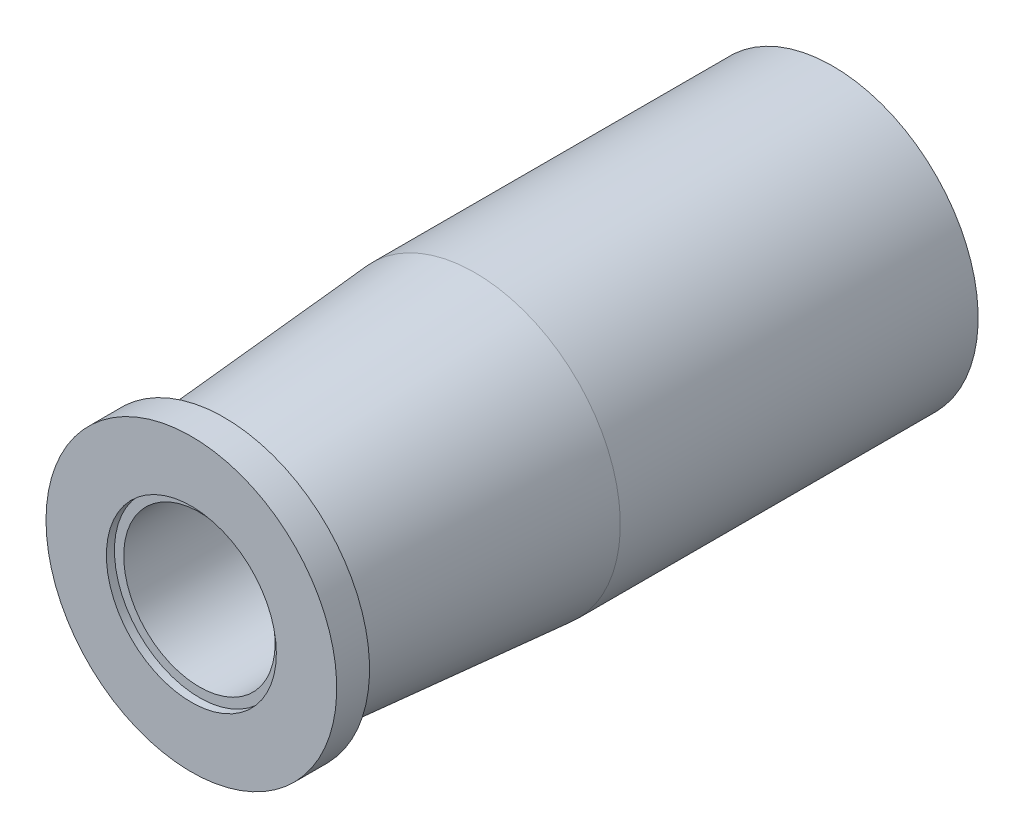
ISO-10303-21;
HEADER;
FILE_DESCRIPTION(('STEP AP214'),'2;1');
FILE_NAME('part.step','',(''),(''),'','','');
FILE_SCHEMA(('AUTOMOTIVE_DESIGN { 1 0 10303 214 1 1 1 1 }'));
ENDSEC;
DATA;
#1=APPLICATION_CONTEXT('core data for automotive mechanical design processes');
#2=APPLICATION_PROTOCOL_DEFINITION('international standard','automotive_design',2000,#1);
#3=PRODUCT_CONTEXT('',#1,'mechanical');
#4=PRODUCT('Part','Part','',(#3));
#5=PRODUCT_RELATED_PRODUCT_CATEGORY('part','',(#4));
#6=PRODUCT_DEFINITION_FORMATION('','',#4);
#7=PRODUCT_DEFINITION_CONTEXT('part definition',#1,'design');
#8=PRODUCT_DEFINITION('design','',#6,#7);
#9=PRODUCT_DEFINITION_SHAPE('','',#8);
#10=(LENGTH_UNIT() NAMED_UNIT(*) SI_UNIT(.MILLI.,.METRE.));
#11=(NAMED_UNIT(*) PLANE_ANGLE_UNIT() SI_UNIT($,.RADIAN.));
#12=(NAMED_UNIT(*) SI_UNIT($,.STERADIAN.) SOLID_ANGLE_UNIT());
#13=UNCERTAINTY_MEASURE_WITH_UNIT(LENGTH_MEASURE(1.E-05),#10,'distance_accuracy_value','');
#14=(GEOMETRIC_REPRESENTATION_CONTEXT(3) GLOBAL_UNCERTAINTY_ASSIGNED_CONTEXT((#13)) GLOBAL_UNIT_ASSIGNED_CONTEXT((#10,
#11,#12)) REPRESENTATION_CONTEXT('',''));
#15=CARTESIAN_POINT('',(0.,0.,0.));
#16=DIRECTION('',(0.,0.,1.));
#17=DIRECTION('',(1.,0.,0.));
#18=AXIS2_PLACEMENT_3D('',#15,#16,#17);
#19=CARTESIAN_POINT('',(0.,0.,0.));
#20=DIRECTION('',(0.,0.,1.));
#21=DIRECTION('',(1.,0.,0.));
#22=AXIS2_PLACEMENT_3D('',#19,#20,#21);
#23=PLANE('',#22);
#24=CARTESIAN_POINT('',(0.,0.,0.));
#25=DIRECTION('',(0.,0.,1.));
#26=DIRECTION('',(1.,0.,0.));
#27=AXIS2_PLACEMENT_3D('',#24,#25,#26);
#28=CIRCLE('',#27,2.85);
#29=CARTESIAN_POINT('',(2.85,0.,0.));
#30=VERTEX_POINT('',#29);
#31=EDGE_CURVE('E64',#30,#30,#28,.T.);
#32=ORIENTED_EDGE('',*,*,#31,.F.);
#33=EDGE_LOOP('',(#32));
#34=FACE_BOUND('',#33,.T.);
#35=CARTESIAN_POINT('',(0.,0.,0.));
#36=DIRECTION('',(0.,0.,-1.));
#37=DIRECTION('',(-1.,0.,0.));
#38=AXIS2_PLACEMENT_3D('',#35,#36,#37);
#39=CIRCLE('',#38,4.875);
#40=CARTESIAN_POINT('',(-4.875,0.,0.));
#41=VERTEX_POINT('',#40);
#42=EDGE_CURVE('E10',#41,#41,#39,.T.);
#43=ORIENTED_EDGE('',*,*,#42,.F.);
#44=EDGE_LOOP('',(#43));
#45=FACE_BOUND('',#44,.T.);
#46=ADVANCED_FACE('F41',(#34,#45),#23,.T.);
#47=CARTESIAN_POINT('',(0.,0.,-21.51));
#48=DIRECTION('',(0.,0.,-1.));
#49=DIRECTION('',(-1.,0.,0.));
#50=AXIS2_PLACEMENT_3D('',#47,#48,#49);
#51=CYLINDRICAL_SURFACE('',#50,4.875);
#52=ORIENTED_EDGE('',*,*,#42,.T.);
#53=EDGE_LOOP('',(#52));
#54=FACE_BOUND('',#53,.T.);
#55=CARTESIAN_POINT('',(0.,0.,-1.1));
#56=DIRECTION('',(0.,0.,-1.));
#57=DIRECTION('',(-1.,0.,0.));
#58=AXIS2_PLACEMENT_3D('',#55,#56,#57);
#59=CIRCLE('',#58,4.875);
#60=CARTESIAN_POINT('',(-4.875,0.,-1.1));
#61=VERTEX_POINT('',#60);
#62=EDGE_CURVE('E48',#61,#61,#59,.T.);
#63=ORIENTED_EDGE('',*,*,#62,.F.);
#64=EDGE_LOOP('',(#63));
#65=FACE_BOUND('',#64,.T.);
#66=ADVANCED_FACE('F111',(#54,#65),#51,.T.);
#67=CARTESIAN_POINT('',(-4.875,0.,-1.1));
#68=DIRECTION('',(0.,0.,-1.));
#69=DIRECTION('',(-1.,0.,0.));
#70=AXIS2_PLACEMENT_3D('',#67,#68,#69);
#71=PLANE('',#70);
#72=ORIENTED_EDGE('',*,*,#62,.T.);
#73=EDGE_LOOP('',(#72));
#74=FACE_BOUND('',#73,.T.);
#75=CARTESIAN_POINT('',(0.,0.,-1.1));
#76=DIRECTION('',(0.,0.,-1.));
#77=DIRECTION('',(-1.,0.,0.));
#78=AXIS2_PLACEMENT_3D('',#75,#76,#77);
#79=CIRCLE('',#78,4.215);
#80=CARTESIAN_POINT('',(-4.215,0.,-1.1));
#81=VERTEX_POINT('',#80);
#82=EDGE_CURVE('E52',#81,#81,#79,.T.);
#83=ORIENTED_EDGE('',*,*,#82,.F.);
#84=EDGE_LOOP('',(#83));
#85=FACE_BOUND('',#84,.T.);
#86=ADVANCED_FACE('F116',(#74,#85),#71,.T.);
#87=CARTESIAN_POINT('',(0.,0.,-9.51));
#88=DIRECTION('',(0.,0.,-1.));
#89=DIRECTION('',(-1.,0.,0.));
#90=AXIS2_PLACEMENT_3D('',#87,#88,#89);
#91=CONICAL_SURFACE('',#90,4.875,0.0783174850931369);
#92=ORIENTED_EDGE('',*,*,#82,.T.);
#93=EDGE_LOOP('',(#92));
#94=FACE_BOUND('',#93,.T.);
#95=CARTESIAN_POINT('',(0.,0.,-9.51));
#96=DIRECTION('',(0.,0.,-1.));
#97=DIRECTION('',(-1.,0.,0.));
#98=AXIS2_PLACEMENT_3D('',#95,#96,#97);
#99=CIRCLE('',#98,4.875);
#100=CARTESIAN_POINT('',(-4.875,0.,-9.51));
#101=VERTEX_POINT('',#100);
#102=EDGE_CURVE('E57',#101,#101,#99,.T.);
#103=ORIENTED_EDGE('',*,*,#102,.F.);
#104=EDGE_LOOP('',(#103));
#105=FACE_BOUND('',#104,.T.);
#106=ADVANCED_FACE('F120',(#94,#105),#91,.T.);
#107=CARTESIAN_POINT('',(0.,0.,-21.51));
#108=DIRECTION('',(0.,0.,-1.));
#109=DIRECTION('',(-1.,0.,0.));
#110=AXIS2_PLACEMENT_3D('',#107,#108,#109);
#111=CYLINDRICAL_SURFACE('',#110,4.875);
#112=ORIENTED_EDGE('',*,*,#102,.T.);
#113=EDGE_LOOP('',(#112));
#114=FACE_BOUND('',#113,.T.);
#115=CARTESIAN_POINT('',(0.,0.,-21.51));
#116=DIRECTION('',(0.,0.,-1.));
#117=DIRECTION('',(-1.,0.,0.));
#118=AXIS2_PLACEMENT_3D('',#115,#116,#117);
#119=CIRCLE('',#118,4.875);
#120=CARTESIAN_POINT('',(-4.875,0.,-21.51));
#121=VERTEX_POINT('',#120);
#122=EDGE_CURVE('E60',#121,#121,#119,.T.);
#123=ORIENTED_EDGE('',*,*,#122,.F.);
#124=EDGE_LOOP('',(#123));
#125=FACE_BOUND('',#124,.T.);
#126=ADVANCED_FACE('F127',(#114,#125),#111,.T.);
#127=CARTESIAN_POINT('',(-4.875,0.,-21.51));
#128=DIRECTION('',(0.,0.,-1.));
#129=DIRECTION('',(-1.,0.,0.));
#130=AXIS2_PLACEMENT_3D('',#127,#128,#129);
#131=PLANE('',#130);
#132=CARTESIAN_POINT('',(0.,0.,-21.51));
#133=DIRECTION('',(0.,0.,-1.));
#134=DIRECTION('',(-1.,0.,0.));
#135=AXIS2_PLACEMENT_3D('',#132,#133,#134);
#136=CIRCLE('',#135,1.5);
#137=CARTESIAN_POINT('',(-1.5,0.,-21.51));
#138=VERTEX_POINT('',#137);
#139=EDGE_CURVE('E75',#138,#138,#136,.T.);
#140=ORIENTED_EDGE('',*,*,#139,.F.);
#141=EDGE_LOOP('',(#140));
#142=FACE_BOUND('',#141,.T.);
#143=ORIENTED_EDGE('',*,*,#122,.T.);
#144=EDGE_LOOP('',(#143));
#145=FACE_BOUND('',#144,.T.);
#146=ADVANCED_FACE('F105',(#142,#145),#131,.T.);
#147=CARTESIAN_POINT('',(0.,0.,-0.27));
#148=DIRECTION('',(0.,0.,1.));
#149=DIRECTION('',(1.,0.,0.));
#150=AXIS2_PLACEMENT_3D('',#147,#148,#149);
#151=CYLINDRICAL_SURFACE('',#150,2.85);
#152=CARTESIAN_POINT('',(0.,0.,-0.27));
#153=DIRECTION('',(0.,0.,1.));
#154=DIRECTION('',(1.,0.,0.));
#155=AXIS2_PLACEMENT_3D('',#152,#153,#154);
#156=CIRCLE('',#155,2.85);
#157=CARTESIAN_POINT('',(2.85,0.,-0.27));
#158=VERTEX_POINT('',#157);
#159=EDGE_CURVE('E63',#158,#158,#156,.T.);
#160=ORIENTED_EDGE('',*,*,#159,.F.);
#161=EDGE_LOOP('',(#160));
#162=FACE_BOUND('',#161,.T.);
#163=ORIENTED_EDGE('',*,*,#31,.T.);
#164=EDGE_LOOP('',(#163));
#165=FACE_BOUND('',#164,.T.);
#166=ADVANCED_FACE('F99',(#162,#165),#151,.F.);
#167=CARTESIAN_POINT('',(0.,0.,-0.27));
#168=DIRECTION('',(0.,0.,1.));
#169=DIRECTION('',(1.,0.,0.));
#170=AXIS2_PLACEMENT_3D('',#167,#168,#169);
#171=PLANE('',#170);
#172=CARTESIAN_POINT('',(0.,0.,-0.27));
#173=DIRECTION('',(0.,0.,1.));
#174=DIRECTION('',(1.,0.,0.));
#175=AXIS2_PLACEMENT_3D('',#172,#173,#174);
#176=CIRCLE('',#175,2.53914196194298);
#177=CARTESIAN_POINT('',(2.53914196194298,0.,-0.27));
#178=VERTEX_POINT('',#177);
#179=EDGE_CURVE('E70',#178,#178,#176,.T.);
#180=ORIENTED_EDGE('',*,*,#179,.F.);
#181=EDGE_LOOP('',(#180));
#182=FACE_BOUND('',#181,.T.);
#183=ORIENTED_EDGE('',*,*,#159,.T.);
#184=EDGE_LOOP('',(#183));
#185=FACE_BOUND('',#184,.T.);
#186=ADVANCED_FACE('F93',(#182,#185),#171,.T.);
#187=CARTESIAN_POINT('',(0.,0.,-5.27));
#188=DIRECTION('',(0.,0.,1.));
#189=DIRECTION('',(1.,0.,0.));
#190=AXIS2_PLACEMENT_3D('',#187,#188,#189);
#191=CYLINDRICAL_SURFACE('',#190,2.53914196194298);
#192=CARTESIAN_POINT('',(0.,0.,-5.27));
#193=DIRECTION('',(0.,0.,1.));
#194=DIRECTION('',(1.,0.,0.));
#195=AXIS2_PLACEMENT_3D('',#192,#193,#194);
#196=CIRCLE('',#195,2.53914196194298);
#197=CARTESIAN_POINT('',(2.53914196194298,0.,-5.27));
#198=VERTEX_POINT('',#197);
#199=EDGE_CURVE('E67',#198,#198,#196,.T.);
#200=ORIENTED_EDGE('',*,*,#199,.F.);
#201=EDGE_LOOP('',(#200));
#202=FACE_BOUND('',#201,.T.);
#203=ORIENTED_EDGE('',*,*,#179,.T.);
#204=EDGE_LOOP('',(#203));
#205=FACE_BOUND('',#204,.T.);
#206=ADVANCED_FACE('F87',(#202,#205),#191,.F.);
#207=CARTESIAN_POINT('',(0.,0.,-5.27));
#208=DIRECTION('',(0.,0.,1.));
#209=DIRECTION('',(1.,0.,0.));
#210=AXIS2_PLACEMENT_3D('',#207,#208,#209);
#211=PLANE('',#210);
#212=CARTESIAN_POINT('',(0.,0.,-5.27));
#213=DIRECTION('',(0.,0.,1.));
#214=DIRECTION('',(1.,0.,0.));
#215=AXIS2_PLACEMENT_3D('',#212,#213,#214);
#216=CIRCLE('',#215,1.5);
#217=CARTESIAN_POINT('',(1.5,0.,-5.27));
#218=VERTEX_POINT('',#217);
#219=EDGE_CURVE('E44',#218,#218,#216,.T.);
#220=ORIENTED_EDGE('',*,*,#219,.F.);
#221=EDGE_LOOP('',(#220));
#222=FACE_BOUND('',#221,.T.);
#223=ORIENTED_EDGE('',*,*,#199,.T.);
#224=EDGE_LOOP('',(#223));
#225=FACE_BOUND('',#224,.T.);
#226=ADVANCED_FACE('F84',(#222,#225),#211,.T.);
#227=CARTESIAN_POINT('',(0.,0.,-2.51));
#228=DIRECTION('',(0.,0.,-1.));
#229=DIRECTION('',(-1.,0.,0.));
#230=AXIS2_PLACEMENT_3D('',#227,#228,#229);
#231=CYLINDRICAL_SURFACE('',#230,1.5);
#232=ORIENTED_EDGE('',*,*,#219,.T.);
#233=EDGE_LOOP('',(#232));
#234=FACE_BOUND('',#233,.T.);
#235=ORIENTED_EDGE('',*,*,#139,.T.);
#236=EDGE_LOOP('',(#235));
#237=FACE_BOUND('',#236,.T.);
#238=ADVANCED_FACE('F82',(#234,#237),#231,.F.);
#239=CLOSED_SHELL('',(#46,#66,#86,#106,#126,#146,#166,#186,#206,#226,#238));
#240=MANIFOLD_SOLID_BREP('B2',#239);
#241=ADVANCED_BREP_SHAPE_REPRESENTATION('',(#18,#240),#14);
#242=SHAPE_DEFINITION_REPRESENTATION(#9,#241);
ENDSEC;
END-ISO-10303-21;
